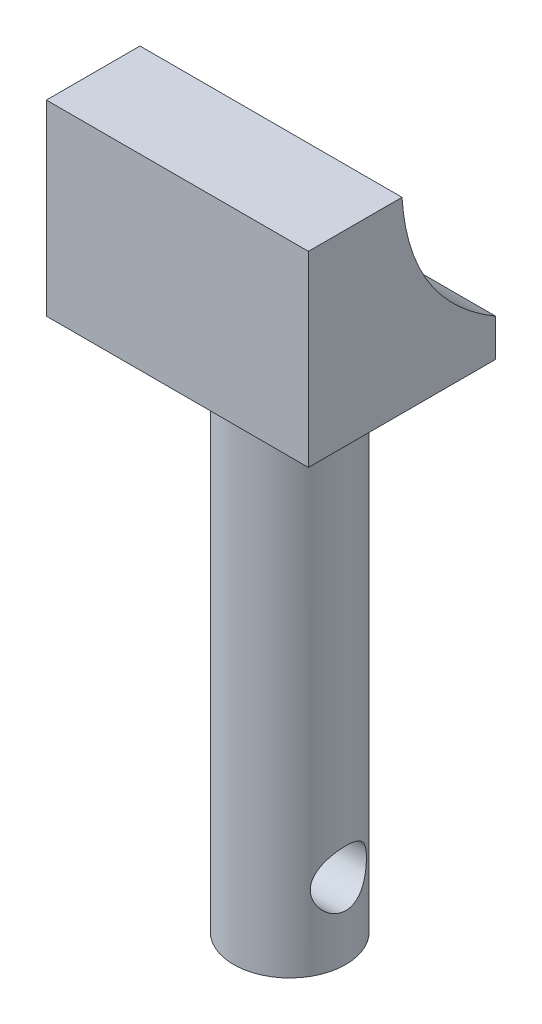
ISO-10303-21;
HEADER;
FILE_DESCRIPTION(('STEP AP214'),'2;1');
FILE_NAME('part.step','',(''),(''),'','','');
FILE_SCHEMA(('AUTOMOTIVE_DESIGN { 1 0 10303 214 1 1 1 1 }'));
ENDSEC;
DATA;
#1=APPLICATION_CONTEXT('core data for automotive mechanical design processes');
#2=APPLICATION_PROTOCOL_DEFINITION('international standard','automotive_design',2000,#1);
#3=PRODUCT_CONTEXT('',#1,'mechanical');
#4=PRODUCT('Part','Part','',(#3));
#5=PRODUCT_RELATED_PRODUCT_CATEGORY('part','',(#4));
#6=PRODUCT_DEFINITION_FORMATION('','',#4);
#7=PRODUCT_DEFINITION_CONTEXT('part definition',#1,'design');
#8=PRODUCT_DEFINITION('design','',#6,#7);
#9=PRODUCT_DEFINITION_SHAPE('','',#8);
#10=(LENGTH_UNIT() NAMED_UNIT(*) SI_UNIT(.MILLI.,.METRE.));
#11=(NAMED_UNIT(*) PLANE_ANGLE_UNIT() SI_UNIT($,.RADIAN.));
#12=(NAMED_UNIT(*) SI_UNIT($,.STERADIAN.) SOLID_ANGLE_UNIT());
#13=UNCERTAINTY_MEASURE_WITH_UNIT(LENGTH_MEASURE(1.E-05),#10,'distance_accuracy_value','');
#14=(GEOMETRIC_REPRESENTATION_CONTEXT(3) GLOBAL_UNCERTAINTY_ASSIGNED_CONTEXT((#13)) GLOBAL_UNIT_ASSIGNED_CONTEXT((#10,
#11,#12)) REPRESENTATION_CONTEXT('',''));
#15=CARTESIAN_POINT('',(0.,0.,0.));
#16=DIRECTION('',(0.,0.,1.));
#17=DIRECTION('',(1.,0.,0.));
#18=AXIS2_PLACEMENT_3D('',#15,#16,#17);
#19=CARTESIAN_POINT('',(-4.69986884007452,4.67253304462365,5.));
#20=DIRECTION('',(1.,0.,0.));
#21=DIRECTION('',(0.,1.,0.));
#22=AXIS2_PLACEMENT_3D('',#19,#20,#21);
#23=PLANE('',#22);
#24=DIRECTION('',(0.,0.,-1.));
#25=VECTOR('',#24,1.);
#26=CARTESIAN_POINT('',(-4.69986884007452,4.67253304462365,5.));
#27=LINE('',#26,#25);
#28=CARTESIAN_POINT('',(-4.69986884007452,4.67253304462365,5.));
#29=VERTEX_POINT('',#28);
#30=CARTESIAN_POINT('',(-4.69986884007452,4.67253304462365,2.5));
#31=VERTEX_POINT('',#30);
#32=EDGE_CURVE('E115',#29,#31,#27,.T.);
#33=ORIENTED_EDGE('',*,*,#32,.T.);
#34=CARTESIAN_POINT('',(-4.69986884007452,0.672533044623654,0.));
#35=CARTESIAN_POINT('',(-4.69986884007452,2.03967348232504,2.33100994318035));
#36=CARTESIAN_POINT('',(-4.69986884007452,4.67253304462365,2.5));
#37=B_SPLINE_CURVE_WITH_KNOTS('',2,(#34,#35,#36),.UNSPECIFIED.,.F.,.F.,(3,3),(0.,1.),.UNSPECIFIED.);
#38=CARTESIAN_POINT('',(-4.69986884007452,0.672533044623654,0.));
#39=VERTEX_POINT('',#38);
#40=EDGE_CURVE('E98',#39,#31,#37,.T.);
#41=ORIENTED_EDGE('',*,*,#40,.F.);
#42=DIRECTION('',(0.,-1.,0.));
#43=VECTOR('',#42,1.);
#44=CARTESIAN_POINT('',(-4.69986884007452,4.67253304462365,0.));
#45=LINE('',#44,#43);
#46=CARTESIAN_POINT('',(-4.69986884007452,-0.327466955376346,0.));
#47=VERTEX_POINT('',#46);
#48=EDGE_CURVE('E161',#39,#47,#45,.T.);
#49=ORIENTED_EDGE('',*,*,#48,.T.);
#50=DIRECTION('',(0.,0.,-1.));
#51=VECTOR('',#50,1.);
#52=CARTESIAN_POINT('',(-4.69986884007452,-0.327466955376346,5.));
#53=LINE('',#52,#51);
#54=CARTESIAN_POINT('',(-4.69986884007452,-0.327466955376346,5.));
#55=VERTEX_POINT('',#54);
#56=EDGE_CURVE('E49',#55,#47,#53,.T.);
#57=ORIENTED_EDGE('',*,*,#56,.F.);
#58=DIRECTION('',(0.,-1.,0.));
#59=VECTOR('',#58,1.);
#60=CARTESIAN_POINT('',(-4.69986884007452,4.67253304462365,5.));
#61=LINE('',#60,#59);
#62=EDGE_CURVE('E153',#29,#55,#61,.T.);
#63=ORIENTED_EDGE('',*,*,#62,.F.);
#64=EDGE_LOOP('',(#33,#41,#49,#57,#63));
#65=FACE_BOUND('',#64,.T.);
#66=ADVANCED_FACE('F36',(#65),#23,.F.);
#67=CARTESIAN_POINT('',(-4.69986884007452,-0.327466955376346,5.));
#68=DIRECTION('',(0.,1.,0.));
#69=DIRECTION('',(0.,0.,1.));
#70=AXIS2_PLACEMENT_3D('',#67,#68,#69);
#71=PLANE('',#70);
#72=CARTESIAN_POINT('',(-1.19986884007452,-0.327466955376346,2.));
#73=DIRECTION('',(0.,-1.,0.));
#74=DIRECTION('',(0.,0.,-1.));
#75=AXIS2_PLACEMENT_3D('',#72,#73,#74);
#76=CIRCLE('',#75,1.5);
#77=CARTESIAN_POINT('',(-1.19986884007452,-0.327466955376346,0.5));
#78=VERTEX_POINT('',#77);
#79=EDGE_CURVE('E11',#78,#78,#76,.T.);
#80=ORIENTED_EDGE('',*,*,#79,.F.);
#81=EDGE_LOOP('',(#80));
#82=FACE_BOUND('',#81,.T.);
#83=DIRECTION('',(1.,0.,0.));
#84=VECTOR('',#83,1.);
#85=CARTESIAN_POINT('',(-4.69986884007452,-0.327466955376346,0.));
#86=LINE('',#85,#84);
#87=CARTESIAN_POINT('',(2.30013115992548,-0.327466955376346,0.));
#88=VERTEX_POINT('',#87);
#89=EDGE_CURVE('E82',#47,#88,#86,.T.);
#90=ORIENTED_EDGE('',*,*,#89,.T.);
#91=DIRECTION('',(0.,0.,-1.));
#92=VECTOR('',#91,1.);
#93=CARTESIAN_POINT('',(2.30013115992548,-0.327466955376346,5.));
#94=LINE('',#93,#92);
#95=CARTESIAN_POINT('',(2.30013115992548,-0.327466955376346,5.));
#96=VERTEX_POINT('',#95);
#97=EDGE_CURVE('E114',#96,#88,#94,.T.);
#98=ORIENTED_EDGE('',*,*,#97,.F.);
#99=DIRECTION('',(1.,0.,0.));
#100=VECTOR('',#99,1.);
#101=CARTESIAN_POINT('',(-4.69986884007452,-0.327466955376346,5.));
#102=LINE('',#101,#100);
#103=EDGE_CURVE('E87',#55,#96,#102,.T.);
#104=ORIENTED_EDGE('',*,*,#103,.F.);
#105=ORIENTED_EDGE('',*,*,#56,.T.);
#106=EDGE_LOOP('',(#90,#98,#104,#105));
#107=FACE_BOUND('',#106,.T.);
#108=ADVANCED_FACE('F144',(#82,#107),#71,.F.);
#109=CARTESIAN_POINT('',(2.30013115992548,4.67253304462365,5.));
#110=DIRECTION('',(-1.,0.,0.));
#111=DIRECTION('',(0.,0.,1.));
#112=AXIS2_PLACEMENT_3D('',#109,#110,#111);
#113=PLANE('',#112);
#114=DIRECTION('',(0.,1.,0.));
#115=VECTOR('',#114,1.);
#116=CARTESIAN_POINT('',(2.30013115992548,4.67253304462365,0.));
#117=LINE('',#116,#115);
#118=CARTESIAN_POINT('',(2.30013115992548,0.672533044623656,0.));
#119=VERTEX_POINT('',#118);
#120=EDGE_CURVE('E111',#88,#119,#117,.T.);
#121=ORIENTED_EDGE('',*,*,#120,.T.);
#122=CARTESIAN_POINT('',(2.30013115992548,0.672533044623656,0.));
#123=CARTESIAN_POINT('',(2.30013115992548,2.03967348232504,2.33100994318035));
#124=CARTESIAN_POINT('',(2.30013115992548,4.67253304462366,2.5));
#125=B_SPLINE_CURVE_WITH_KNOTS('',2,(#122,#123,#124),.UNSPECIFIED.,.F.,.F.,(3,3),(0.,1.),.UNSPECIFIED.);
#126=CARTESIAN_POINT('',(2.30013115992548,4.67253304462366,2.5));
#127=VERTEX_POINT('',#126);
#128=EDGE_CURVE('E57',#119,#127,#125,.T.);
#129=ORIENTED_EDGE('',*,*,#128,.T.);
#130=DIRECTION('',(0.,0.,-1.));
#131=VECTOR('',#130,1.);
#132=CARTESIAN_POINT('',(2.30013115992548,4.67253304462365,5.));
#133=LINE('',#132,#131);
#134=CARTESIAN_POINT('',(2.30013115992548,4.67253304462365,5.));
#135=VERTEX_POINT('',#134);
#136=EDGE_CURVE('E109',#135,#127,#133,.T.);
#137=ORIENTED_EDGE('',*,*,#136,.F.);
#138=DIRECTION('',(0.,1.,0.));
#139=VECTOR('',#138,1.);
#140=CARTESIAN_POINT('',(2.30013115992548,4.67253304462365,5.));
#141=LINE('',#140,#139);
#142=EDGE_CURVE('E155',#96,#135,#141,.T.);
#143=ORIENTED_EDGE('',*,*,#142,.F.);
#144=ORIENTED_EDGE('',*,*,#97,.T.);
#145=EDGE_LOOP('',(#121,#129,#137,#143,#144));
#146=FACE_BOUND('',#145,.T.);
#147=ADVANCED_FACE('F107',(#146),#113,.F.);
#148=CARTESIAN_POINT('',(-4.69986884007452,4.67253304462365,5.));
#149=DIRECTION('',(0.,-1.,0.));
#150=DIRECTION('',(0.,0.,-1.));
#151=AXIS2_PLACEMENT_3D('',#148,#149,#150);
#152=PLANE('',#151);
#153=ORIENTED_EDGE('',*,*,#136,.T.);
#154=DIRECTION('',(-1.,0.,0.));
#155=VECTOR('',#154,1.);
#156=CARTESIAN_POINT('',(2.30013115992548,4.67253304462366,2.5));
#157=LINE('',#156,#155);
#158=EDGE_CURVE('E95',#127,#31,#157,.T.);
#159=ORIENTED_EDGE('',*,*,#158,.T.);
#160=ORIENTED_EDGE('',*,*,#32,.F.);
#161=DIRECTION('',(-1.,0.,0.));
#162=VECTOR('',#161,1.);
#163=CARTESIAN_POINT('',(-4.69986884007452,4.67253304462365,5.));
#164=LINE('',#163,#162);
#165=EDGE_CURVE('E66',#135,#29,#164,.T.);
#166=ORIENTED_EDGE('',*,*,#165,.F.);
#167=EDGE_LOOP('',(#153,#159,#160,#166));
#168=FACE_BOUND('',#167,.T.);
#169=ADVANCED_FACE('F113',(#168),#152,.F.);
#170=CARTESIAN_POINT('',(0.,0.,5.));
#171=DIRECTION('',(0.,0.,1.));
#172=DIRECTION('',(1.,0.,0.));
#173=AXIS2_PLACEMENT_3D('',#170,#171,#172);
#174=PLANE('',#173);
#175=ORIENTED_EDGE('',*,*,#62,.T.);
#176=ORIENTED_EDGE('',*,*,#103,.T.);
#177=ORIENTED_EDGE('',*,*,#142,.T.);
#178=ORIENTED_EDGE('',*,*,#165,.T.);
#179=EDGE_LOOP('',(#175,#176,#177,#178));
#180=FACE_BOUND('',#179,.T.);
#181=ADVANCED_FACE('F180',(#180),#174,.T.);
#182=CARTESIAN_POINT('',(0.,0.,0.));
#183=DIRECTION('',(0.,0.,1.));
#184=DIRECTION('',(1.,0.,0.));
#185=AXIS2_PLACEMENT_3D('',#182,#183,#184);
#186=PLANE('',#185);
#187=ORIENTED_EDGE('',*,*,#48,.F.);
#188=DIRECTION('',(-1.,0.,0.));
#189=VECTOR('',#188,1.);
#190=CARTESIAN_POINT('',(2.30013115992548,0.672533044623656,0.));
#191=LINE('',#190,#189);
#192=EDGE_CURVE('E102',#119,#39,#191,.T.);
#193=ORIENTED_EDGE('',*,*,#192,.F.);
#194=ORIENTED_EDGE('',*,*,#120,.F.);
#195=ORIENTED_EDGE('',*,*,#89,.F.);
#196=EDGE_LOOP('',(#187,#193,#194,#195));
#197=FACE_BOUND('',#196,.T.);
#198=ADVANCED_FACE('F179',(#197),#186,.F.);
#199=DIRECTION('',(-1.,0.,0.));
#200=VECTOR('',#199,1.);
#201=SURFACE_OF_LINEAR_EXTRUSION('',#125,#200);
#202=ORIENTED_EDGE('',*,*,#40,.T.);
#203=ORIENTED_EDGE('',*,*,#158,.F.);
#204=ORIENTED_EDGE('',*,*,#128,.F.);
#205=ORIENTED_EDGE('',*,*,#192,.T.);
#206=EDGE_LOOP('',(#202,#203,#204,#205));
#207=FACE_BOUND('',#206,.T.);
#208=ADVANCED_FACE('F96',(#207),#201,.F.);
#209=CARTESIAN_POINT('',(-1.19986884007452,-14.3274669553763,2.));
#210=DIRECTION('',(0.,1.,0.));
#211=DIRECTION('',(0.,0.,1.));
#212=AXIS2_PLACEMENT_3D('',#209,#210,#211);
#213=CYLINDRICAL_SURFACE('',#212,1.5);
#214=CARTESIAN_POINT('',(0.0991692656021395,-12.3274669553763,2.74999999999999));
#215=CARTESIAN_POINT('',(0.099172670388925,-12.2883860992299,2.74999727230589));
#216=CARTESIAN_POINT('',(0.100959668833655,-12.2492558967326,2.74692497804991));
#217=CARTESIAN_POINT('',(0.107848908315875,-12.1721965068685,2.73479240742353));
#218=CARTESIAN_POINT('',(0.112958115342177,-12.1342700190938,2.72571954841563));
#219=CARTESIAN_POINT('',(0.125751259465969,-12.0608782071184,2.70207496152485));
#220=CARTESIAN_POINT('',(0.133421485974871,-12.0254009660212,2.68753246437029));
#221=CARTESIAN_POINT('',(0.150451146051914,-11.9573988038788,2.65345064403227));
#222=CARTESIAN_POINT('',(0.159810670995965,-11.9248740426795,2.63391105052682));
#223=CARTESIAN_POINT('',(0.180107677856291,-11.8607376589582,2.58849990539815));
#224=CARTESIAN_POINT('',(0.191111637210131,-11.8294226036212,2.56223902710782));
#225=CARTESIAN_POINT('',(0.212921030818272,-11.7714106640713,2.50494035571085));
#226=CARTESIAN_POINT('',(0.223726363659854,-11.7447160834387,2.47390019433671));
#227=CARTESIAN_POINT('',(0.244792237072597,-11.6949415920156,2.4053671725609));
#228=CARTESIAN_POINT('',(0.254966958061772,-11.6722266294817,2.36758039175943));
#229=CARTESIAN_POINT('',(0.272761830671946,-11.633611315442,2.28811776994963));
#230=CARTESIAN_POINT('',(0.28038359380354,-11.6177066632735,2.24644440360361));
#231=CARTESIAN_POINT('',(0.291734619257259,-11.5943384594005,2.16353370794448));
#232=CARTESIAN_POINT('',(0.295702261582168,-11.5863548106097,2.12247634286661));
#233=CARTESIAN_POINT('',(0.30018803877098,-11.5773423663701,2.03942797152339));
#234=CARTESIAN_POINT('',(0.300708260809901,-11.5763093627796,1.9974375456172));
#235=CARTESIAN_POINT('',(0.298353524298854,-11.5810269608541,1.91762560668219));
#236=CARTESIAN_POINT('',(0.295769879116681,-11.5861954670173,1.87975910061741));
#237=CARTESIAN_POINT('',(0.287937999373584,-11.6021275883048,1.80551467106126));
#238=CARTESIAN_POINT('',(0.282689565423431,-11.6128916221085,1.76913685917956));
#239=CARTESIAN_POINT('',(0.269918034582886,-11.6397788799437,1.69826795632284));
#240=CARTESIAN_POINT('',(0.262364471394472,-11.6559741902554,1.66380993236362));
#241=CARTESIAN_POINT('',(0.245663504825632,-11.6931645175275,1.59801739886501));
#242=CARTESIAN_POINT('',(0.236515531106609,-11.7141612528531,1.56668401337102));
#243=CARTESIAN_POINT('',(0.216464117919698,-11.7626384690261,1.50486975432636));
#244=CARTESIAN_POINT('',(0.205476479911792,-11.7905442266209,1.47474944372798));
#245=CARTESIAN_POINT('',(0.183538714326567,-11.850909249074,1.41942172227667));
#246=CARTESIAN_POINT('',(0.172588621917696,-11.8833719845819,1.39421809131933));
#247=CARTESIAN_POINT('',(0.151212330619115,-11.9544530996944,1.34787099901835));
#248=CARTESIAN_POINT('',(0.140863559855787,-11.993331472667,1.32708701376647));
#249=CARTESIAN_POINT('',(0.1229470370148,-12.0746702088956,1.29251066524908));
#250=CARTESIAN_POINT('',(0.115376385270987,-12.1171267801395,1.27871100634184));
#251=CARTESIAN_POINT('',(0.10471592855324,-12.2008778388384,1.25961484173123));
#252=CARTESIAN_POINT('',(0.101318578789205,-12.241997794659,1.25373115841003));
#253=CARTESIAN_POINT('',(0.0985155551375536,-12.3247679615138,1.24886229004144));
#254=CARTESIAN_POINT('',(0.0991070615953192,-12.3664177772162,1.24987223201374));
#255=CARTESIAN_POINT('',(0.103888683979869,-12.4442073943104,1.25822296749203));
#256=CARTESIAN_POINT('',(0.107678066225388,-12.4804515437073,1.26485913746566));
#257=CARTESIAN_POINT('',(0.11783632156054,-12.5512427950796,1.28322778652568));
#258=CARTESIAN_POINT('',(0.124206029963236,-12.5857893434363,1.2949619160323));
#259=CARTESIAN_POINT('',(0.139152825522906,-12.6540254535534,1.32376430854634));
#260=CARTESIAN_POINT('',(0.147818484248455,-12.6876012180165,1.34105445223047));
#261=CARTESIAN_POINT('',(0.166302056154853,-12.7515689090306,1.38028470198815));
#262=CARTESIAN_POINT('',(0.176120560089087,-12.7819591880113,1.40222719675085));
#263=CARTESIAN_POINT('',(0.197291148348,-12.842701031019,1.45337212460087));
#264=CARTESIAN_POINT('',(0.208680533582648,-12.8725648184146,1.48314104576378));
#265=CARTESIAN_POINT('',(0.230637922259674,-12.9270261338715,1.54744662845129));
#266=CARTESIAN_POINT('',(0.241205647483299,-12.9516218830492,1.5819848940085));
#267=CARTESIAN_POINT('',(0.260691372607655,-12.9953972498389,1.65609847808094));
#268=CARTESIAN_POINT('',(0.269558472465698,-13.0144167940345,1.69578267681942));
#269=CARTESIAN_POINT('',(0.284256322120236,-13.0453203832694,1.77835822651919));
#270=CARTESIAN_POINT('',(0.290089737498276,-13.0572106939011,1.82124672395587));
#271=CARTESIAN_POINT('',(0.297637471289598,-13.0724933785073,1.90476523825219));
#272=CARTESIAN_POINT('',(0.299680619236912,-13.0765653622834,1.94524141711216));
#273=CARTESIAN_POINT('',(0.300447137738961,-13.0780994044671,2.02634448946341));
#274=CARTESIAN_POINT('',(0.299171670427152,-13.075563776769,2.06697132522132));
#275=CARTESIAN_POINT('',(0.293635926209897,-13.0644046502796,2.14440349423786));
#276=CARTESIAN_POINT('',(0.289577869935402,-13.0561933184331,2.18128423835845));
#277=CARTESIAN_POINT('',(0.279071862401152,-13.0344717058991,2.25308446413771));
#278=CARTESIAN_POINT('',(0.272623568421445,-13.0209606653062,2.28800366371663));
#279=CARTESIAN_POINT('',(0.257575640536378,-12.9884216662519,2.35656755468366));
#280=CARTESIAN_POINT('',(0.24889578891647,-12.9691824629705,2.39009385702503));
#281=CARTESIAN_POINT('',(0.230292158489173,-12.9259985072321,2.45358098136052));
#282=CARTESIAN_POINT('',(0.220367809113182,-12.9020515935396,2.48354015556118));
#283=CARTESIAN_POINT('',(0.199095736625186,-12.8473691011093,2.54218550311767));
#284=CARTESIAN_POINT('',(0.187704652513213,-12.8161950897684,2.57044826340445));
#285=CARTESIAN_POINT('',(0.165604231146871,-12.749378914529,2.621497465546));
#286=CARTESIAN_POINT('',(0.15489550313947,-12.7137328397256,2.64427906250754));
#287=CARTESIAN_POINT('',(0.135128199712351,-12.6374894704406,2.68432330983924));
#288=CARTESIAN_POINT('',(0.126132466847507,-12.5967713070298,2.7013887994707));
#289=CARTESIAN_POINT('',(0.111627332388118,-12.5124676521215,2.7281590321298));
#290=CARTESIAN_POINT('',(0.106106281033246,-12.4688922886918,2.7378883933815));
#291=CARTESIAN_POINT('',(0.10160070443891,-12.4086129386373,2.7457752558983));
#292=CARTESIAN_POINT('',(0.10069212746412,-12.3924410345779,2.74735707872288));
#293=CARTESIAN_POINT('',(0.0994756790836076,-12.3600045948647,2.74947005381747));
#294=CARTESIAN_POINT('',(0.0991678478638015,-12.3437400530869,2.7500011357999));
#295=CARTESIAN_POINT('',(0.0991692656021395,-12.3274669553763,2.74999999999999));
#296=B_SPLINE_CURVE_WITH_KNOTS('',3,(#214,#215,#216,#217,#218,#219,#220,#221,#222,#223,#224,
#225,#226,#227,#228,#229,#230,#231,#232,#233,#234,#235,#236,#237,#238,#239,#240,#241,#242,#243,
#244,#245,#246,#247,#248,#249,#250,#251,#252,#253,#254,#255,#256,#257,#258,#259,#260,#261,#262,
#263,#264,#265,#266,#267,#268,#269,#270,#271,#272,#273,#274,#275,#276,#277,#278,#279,#280,#281,
#282,#283,#284,#285,#286,#287,#288,#289,#290,#291,#292,#293,#294,#295),.UNSPECIFIED.,.T.,.F.,(4,
2,2,2,2,2,2,2,2,2,2,2,2,2,2,2,2,2,2,2,2,2,2,2,2,2,2,2,2,2,2,2,2,2,2,2,2,2,2,2,4),(0.,
0.117174091946036,0.234594669618602,0.35139644693916,0.468204544083858,0.594646734373669,
0.721151783132777,0.856184191790719,0.991131202229173,1.1164761372595,1.24174517764529,
1.35612073113403,1.4705048438809,1.58647151048359,1.70247974512702,1.82945393592666,
1.95652536184437,2.09166631297084,2.22666580658777,2.35096718140657,2.47518069891278,
2.58580637568017,2.69646789327045,2.81225472304563,2.92810114665033,3.05855057685458,
3.18904398733649,3.32298136059721,3.45680084856576,3.57834202792112,3.69984065095475,
3.81333318653616,3.92684200134006,4.045205630396,4.16362372575536,4.29382681387547,
4.42414457133862,4.5585806177895,4.69256349752066,4.74135101388978,4.79014179370901),.UNSPECIFIED.);
#297=CARTESIAN_POINT('',(0.0991692656021395,-12.3274669553763,2.74999999999999));
#298=VERTEX_POINT('',#297);
#299=EDGE_CURVE('E39',#298,#298,#296,.T.);
#300=ORIENTED_EDGE('',*,*,#299,.T.);
#301=EDGE_LOOP('',(#300));
#302=FACE_BOUND('',#301,.T.);
#303=CARTESIAN_POINT('',(-2.49890694575119,-12.3274669553763,2.74999999999999));
#304=CARTESIAN_POINT('',(-2.49891035053797,-12.3665478115228,2.74999727230589));
#305=CARTESIAN_POINT('',(-2.5006973489827,-12.4056780140201,2.74692497804991));
#306=CARTESIAN_POINT('',(-2.50758658846492,-12.4827374038842,2.73479240742353));
#307=CARTESIAN_POINT('',(-2.51269579549122,-12.5206638916589,2.72571954841563));
#308=CARTESIAN_POINT('',(-2.52548893961501,-12.5940557036343,2.70207496152485));
#309=CARTESIAN_POINT('',(-2.53315916612392,-12.6295329447315,2.68753246437029));
#310=CARTESIAN_POINT('',(-2.55018882620096,-12.6975351068739,2.65345064403227));
#311=CARTESIAN_POINT('',(-2.55954835114501,-12.7300598680732,2.63391105052682));
#312=CARTESIAN_POINT('',(-2.57984535800534,-12.7941962517945,2.58849990539815));
#313=CARTESIAN_POINT('',(-2.59084931735918,-12.8255113071315,2.56223902710782));
#314=CARTESIAN_POINT('',(-2.61265871096732,-12.8835232466814,2.50494035571085));
#315=CARTESIAN_POINT('',(-2.6234640438089,-12.910217827314,2.47390019433672));
#316=CARTESIAN_POINT('',(-2.64452991722164,-12.9599923187371,2.40536717256091));
#317=CARTESIAN_POINT('',(-2.65470463821082,-12.982707281271,2.36758039175943));
#318=CARTESIAN_POINT('',(-2.67249951082099,-13.0213225953107,2.28811776994963));
#319=CARTESIAN_POINT('',(-2.68012127395259,-13.0372272474792,2.24644440360361));
#320=CARTESIAN_POINT('',(-2.6914722994063,-13.0605954513522,2.16353370794448));
#321=CARTESIAN_POINT('',(-2.69543994173121,-13.068579100143,2.12247634286661));
#322=CARTESIAN_POINT('',(-2.69992571892003,-13.0775915443826,2.03942797152339));
#323=CARTESIAN_POINT('',(-2.70044594095895,-13.0786245479731,1.9974375456172));
#324=CARTESIAN_POINT('',(-2.6980912044479,-13.0739069498986,1.91762560668219));
#325=CARTESIAN_POINT('',(-2.69550755926573,-13.0687384437354,1.87975910061741));
#326=CARTESIAN_POINT('',(-2.68767567952263,-13.0528063224478,1.80551467106126));
#327=CARTESIAN_POINT('',(-2.68242724557248,-13.0420422886442,1.76913685917956));
#328=CARTESIAN_POINT('',(-2.66965571473193,-13.015155030809,1.69826795632284));
#329=CARTESIAN_POINT('',(-2.66210215154352,-12.9989597204973,1.66380993236362));
#330=CARTESIAN_POINT('',(-2.64540118497468,-12.9617693932252,1.59801739886501));
#331=CARTESIAN_POINT('',(-2.63625321125565,-12.9407726578996,1.56668401337102));
#332=CARTESIAN_POINT('',(-2.61620179806874,-12.8922954417266,1.50486975432636));
#333=CARTESIAN_POINT('',(-2.60521416006084,-12.8643896841318,1.47474944372798));
#334=CARTESIAN_POINT('',(-2.58327639447561,-12.8040246616787,1.41942172227667));
#335=CARTESIAN_POINT('',(-2.57232630206674,-12.7715619261708,1.39421809131933));
#336=CARTESIAN_POINT('',(-2.55095001076816,-12.7004808110583,1.34787099901835));
#337=CARTESIAN_POINT('',(-2.54060124000483,-12.6616024380857,1.32708701376647));
#338=CARTESIAN_POINT('',(-2.52268471716385,-12.5802637018571,1.29251066524908));
#339=CARTESIAN_POINT('',(-2.51511406542003,-12.5378071306132,1.27871100634184));
#340=CARTESIAN_POINT('',(-2.50445360870228,-12.4540560719143,1.25961484173123));
#341=CARTESIAN_POINT('',(-2.50105625893825,-12.4129361160937,1.25373115841003));
#342=CARTESIAN_POINT('',(-2.4982532352866,-12.3301659492389,1.24886229004144));
#343=CARTESIAN_POINT('',(-2.49884474174436,-12.2885161335365,1.24987223201374));
#344=CARTESIAN_POINT('',(-2.50362636412891,-12.2107265164423,1.25822296749203));
#345=CARTESIAN_POINT('',(-2.50741574637443,-12.1744823670454,1.26485913746566));
#346=CARTESIAN_POINT('',(-2.51757400170959,-12.1036911156731,1.28322778652568));
#347=CARTESIAN_POINT('',(-2.52394371011228,-12.0691445673164,1.2949619160323));
#348=CARTESIAN_POINT('',(-2.53889050567195,-12.0009084571993,1.32376430854634));
#349=CARTESIAN_POINT('',(-2.5475561643975,-11.9673326927362,1.34105445223047));
#350=CARTESIAN_POINT('',(-2.5660397363039,-11.9033650017221,1.38028470198816));
#351=CARTESIAN_POINT('',(-2.57585824023813,-11.8729747227414,1.40222719675085));
#352=CARTESIAN_POINT('',(-2.59702882849705,-11.8122328797337,1.45337212460087));
#353=CARTESIAN_POINT('',(-2.60841821373169,-11.7823690923381,1.48314104576378));
#354=CARTESIAN_POINT('',(-2.63037560240872,-11.7279077768812,1.54744662845129));
#355=CARTESIAN_POINT('',(-2.64094332763234,-11.7033120277034,1.5819848940085));
#356=CARTESIAN_POINT('',(-2.6604290527567,-11.6595366609138,1.65609847808094));
#357=CARTESIAN_POINT('',(-2.66929615261474,-11.6405171167182,1.69578267681942));
#358=CARTESIAN_POINT('',(-2.68399400226928,-11.6096135274833,1.77835822651919));
#359=CARTESIAN_POINT('',(-2.68982741764732,-11.5977232168516,1.82124672395587));
#360=CARTESIAN_POINT('',(-2.69737515143864,-11.5824405322454,1.90476523825219));
#361=CARTESIAN_POINT('',(-2.69941829938596,-11.5783685484693,1.94524141711216));
#362=CARTESIAN_POINT('',(-2.70018481788801,-11.5768345062856,2.02634448946341));
#363=CARTESIAN_POINT('',(-2.6989093505762,-11.5793701339837,2.06697132522132));
#364=CARTESIAN_POINT('',(-2.69337360635894,-11.5905292604731,2.14440349423786));
#365=CARTESIAN_POINT('',(-2.68931555008445,-11.5987405923196,2.18128423835845));
#366=CARTESIAN_POINT('',(-2.6788095425502,-11.6204622048536,2.25308446413771));
#367=CARTESIAN_POINT('',(-2.67236124857049,-11.6339732454464,2.28800366371663));
#368=CARTESIAN_POINT('',(-2.65731332068542,-11.6665122445008,2.35656755468366));
#369=CARTESIAN_POINT('',(-2.64863346906552,-11.6857514477822,2.39009385702503));
#370=CARTESIAN_POINT('',(-2.63002983863822,-11.7289354035206,2.45358098136052));
#371=CARTESIAN_POINT('',(-2.62010548926223,-11.7528823172131,2.48354015556118));
#372=CARTESIAN_POINT('',(-2.59883341677423,-11.8075648096434,2.54218550311767));
#373=CARTESIAN_POINT('',(-2.58744233266226,-11.8387388209842,2.57044826340445));
#374=CARTESIAN_POINT('',(-2.56534191129592,-11.9055549962237,2.621497465546));
#375=CARTESIAN_POINT('',(-2.55463318328851,-11.9412010710271,2.64427906250754));
#376=CARTESIAN_POINT('',(-2.5348658798614,-12.0174444403121,2.68432330983924));
#377=CARTESIAN_POINT('',(-2.52587014699655,-12.0581626037229,2.7013887994707));
#378=CARTESIAN_POINT('',(-2.51136501253716,-12.1424662586312,2.7281590321298));
#379=CARTESIAN_POINT('',(-2.50584396118229,-12.1860416220609,2.7378883933815));
#380=CARTESIAN_POINT('',(-2.50133838458795,-12.2463209721153,2.7457752558983));
#381=CARTESIAN_POINT('',(-2.50042980761316,-12.2624928761748,2.74735707872288));
#382=CARTESIAN_POINT('',(-2.49921335923265,-12.294929315888,2.74947005381747));
#383=CARTESIAN_POINT('',(-2.49890552801285,-12.3111938576658,2.7500011357999));
#384=CARTESIAN_POINT('',(-2.49890694575119,-12.3274669553763,2.74999999999999));
#385=B_SPLINE_CURVE_WITH_KNOTS('',3,(#303,#304,#305,#306,#307,#308,#309,#310,#311,#312,#313,
#314,#315,#316,#317,#318,#319,#320,#321,#322,#323,#324,#325,#326,#327,#328,#329,#330,#331,#332,
#333,#334,#335,#336,#337,#338,#339,#340,#341,#342,#343,#344,#345,#346,#347,#348,#349,#350,#351,
#352,#353,#354,#355,#356,#357,#358,#359,#360,#361,#362,#363,#364,#365,#366,#367,#368,#369,#370,
#371,#372,#373,#374,#375,#376,#377,#378,#379,#380,#381,#382,#383,#384),.UNSPECIFIED.,.T.,.F.,(4,
2,2,2,2,2,2,2,2,2,2,2,2,2,2,2,2,2,2,2,2,2,2,2,2,2,2,2,2,2,2,2,2,2,2,2,2,2,2,2,4),(0.,
0.117174091946036,0.234594669618602,0.351396446939162,0.46820454408386,0.594646734373671,
0.721151783132774,0.856184191790717,0.991131202229173,1.1164761372595,1.24174517764529,
1.35612073113403,1.4705048438809,1.58647151048359,1.70247974512702,1.82945393592666,
1.95652536184437,2.09166631297084,2.22666580658777,2.35096718140657,2.47518069891278,
2.58580637568017,2.69646789327045,2.81225472304564,2.92810114665033,3.05855057685457,
3.18904398733649,3.32298136059721,3.45680084856576,3.57834202792112,3.69984065095475,
3.81333318653616,3.92684200134006,4.045205630396,4.16362372575536,4.29382681387547,
4.42414457133862,4.5585806177895,4.69256349752066,4.74135101388978,4.79014179370901),.UNSPECIFIED.);
#386=CARTESIAN_POINT('',(-2.49890694575119,-12.3274669553763,2.74999999999999));
#387=VERTEX_POINT('',#386);
#388=EDGE_CURVE('E121',#387,#387,#385,.T.);
#389=ORIENTED_EDGE('',*,*,#388,.T.);
#390=EDGE_LOOP('',(#389));
#391=FACE_BOUND('',#390,.T.);
#392=CARTESIAN_POINT('',(-1.19986884007452,-14.3274669553763,2.));
#393=DIRECTION('',(0.,-1.,0.));
#394=DIRECTION('',(0.,0.,-1.));
#395=AXIS2_PLACEMENT_3D('',#392,#393,#394);
#396=CIRCLE('',#395,1.5);
#397=CARTESIAN_POINT('',(-1.19986884007452,-14.3274669553763,0.5));
#398=VERTEX_POINT('',#397);
#399=EDGE_CURVE('E166',#398,#398,#396,.T.);
#400=ORIENTED_EDGE('',*,*,#399,.F.);
#401=EDGE_LOOP('',(#400));
#402=FACE_BOUND('',#401,.T.);
#403=ORIENTED_EDGE('',*,*,#79,.T.);
#404=EDGE_LOOP('',(#403));
#405=FACE_BOUND('',#404,.T.);
#406=ADVANCED_FACE('F126',(#302,#391,#402,#405),#213,.T.);
#407=CARTESIAN_POINT('',(-1.19986884007452,-14.3274669553763,2.));
#408=DIRECTION('',(0.,-1.,0.));
#409=DIRECTION('',(0.,0.,-1.));
#410=AXIS2_PLACEMENT_3D('',#407,#408,#409);
#411=PLANE('',#410);
#412=ORIENTED_EDGE('',*,*,#399,.T.);
#413=EDGE_LOOP('',(#412));
#414=FACE_BOUND('',#413,.T.);
#415=ADVANCED_FACE('F133',(#414),#411,.T.);
#416=CARTESIAN_POINT('',(-4.69986884007452,-12.3274669553763,2.));
#417=DIRECTION('',(-1.,0.,0.));
#418=DIRECTION('',(0.,0.,1.));
#419=AXIS2_PLACEMENT_3D('',#416,#417,#418);
#420=CYLINDRICAL_SURFACE('',#419,0.749999999999993);
#421=ORIENTED_EDGE('',*,*,#388,.F.);
#422=EDGE_LOOP('',(#421));
#423=FACE_BOUND('',#422,.T.);
#424=ORIENTED_EDGE('',*,*,#299,.F.);
#425=EDGE_LOOP('',(#424));
#426=FACE_BOUND('',#425,.T.);
#427=ADVANCED_FACE('F130',(#423,#426),#420,.F.);
#428=CLOSED_SHELL('',(#66,#108,#147,#169,#181,#198,#208,#406,#415,#427));
#429=MANIFOLD_SOLID_BREP('B2',#428);
#430=ADVANCED_BREP_SHAPE_REPRESENTATION('',(#18,#429),#14);
#431=SHAPE_DEFINITION_REPRESENTATION(#9,#430);
ENDSEC;
END-ISO-10303-21;
